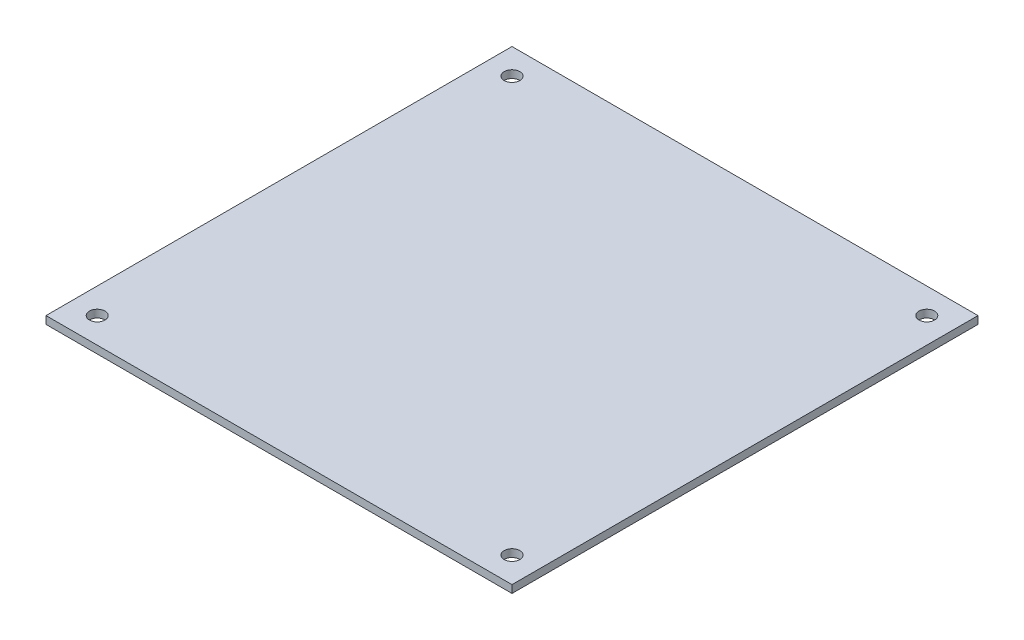
ISO-10303-21;
HEADER;
FILE_DESCRIPTION(('STEP AP214'),'2;1');
FILE_NAME('part.step','',(''),(''),'','','');
FILE_SCHEMA(('AUTOMOTIVE_DESIGN { 1 0 10303 214 1 1 1 1 }'));
ENDSEC;
DATA;
#1=APPLICATION_CONTEXT('core data for automotive mechanical design processes');
#2=APPLICATION_PROTOCOL_DEFINITION('international standard','automotive_design',2000,#1);
#3=PRODUCT_CONTEXT('',#1,'mechanical');
#4=PRODUCT('Part','Part','',(#3));
#5=PRODUCT_RELATED_PRODUCT_CATEGORY('part','',(#4));
#6=PRODUCT_DEFINITION_FORMATION('','',#4);
#7=PRODUCT_DEFINITION_CONTEXT('part definition',#1,'design');
#8=PRODUCT_DEFINITION('design','',#6,#7);
#9=PRODUCT_DEFINITION_SHAPE('','',#8);
#10=(LENGTH_UNIT() NAMED_UNIT(*) SI_UNIT(.MILLI.,.METRE.));
#11=(NAMED_UNIT(*) PLANE_ANGLE_UNIT() SI_UNIT($,.RADIAN.));
#12=(NAMED_UNIT(*) SI_UNIT($,.STERADIAN.) SOLID_ANGLE_UNIT());
#13=UNCERTAINTY_MEASURE_WITH_UNIT(LENGTH_MEASURE(1.E-05),#10,'distance_accuracy_value','');
#14=(GEOMETRIC_REPRESENTATION_CONTEXT(3) GLOBAL_UNCERTAINTY_ASSIGNED_CONTEXT((#13)) GLOBAL_UNIT_ASSIGNED_CONTEXT((#10,
#11,#12)) REPRESENTATION_CONTEXT('',''));
#15=CARTESIAN_POINT('',(0.,0.,0.));
#16=DIRECTION('',(0.,0.,1.));
#17=DIRECTION('',(1.,0.,0.));
#18=AXIS2_PLACEMENT_3D('',#15,#16,#17);
#19=CARTESIAN_POINT('',(0.,1.5,45.5));
#20=DIRECTION('',(0.,0.,-1.));
#21=DIRECTION('',(-1.,0.,0.));
#22=AXIS2_PLACEMENT_3D('',#19,#20,#21);
#23=PLANE('',#22);
#24=DIRECTION('',(1.,0.,0.));
#25=VECTOR('',#24,1.);
#26=CARTESIAN_POINT('',(0.,0.,45.5));
#27=LINE('',#26,#25);
#28=CARTESIAN_POINT('',(-45.5,0.,45.5));
#29=VERTEX_POINT('',#28);
#30=CARTESIAN_POINT('',(45.5,0.,45.5));
#31=VERTEX_POINT('',#30);
#32=EDGE_CURVE('E111',#29,#31,#27,.T.);
#33=ORIENTED_EDGE('',*,*,#32,.T.);
#34=DIRECTION('',(0.,-1.,0.));
#35=VECTOR('',#34,1.);
#36=CARTESIAN_POINT('',(45.5,1.5,45.5));
#37=LINE('',#36,#35);
#38=CARTESIAN_POINT('',(45.5,1.5,45.5));
#39=VERTEX_POINT('',#38);
#40=EDGE_CURVE('E11',#39,#31,#37,.T.);
#41=ORIENTED_EDGE('',*,*,#40,.F.);
#42=DIRECTION('',(1.,0.,0.));
#43=VECTOR('',#42,1.);
#44=CARTESIAN_POINT('',(0.,1.5,45.5));
#45=LINE('',#44,#43);
#46=CARTESIAN_POINT('',(-45.5,1.5,45.5));
#47=VERTEX_POINT('',#46);
#48=EDGE_CURVE('E85',#47,#39,#45,.T.);
#49=ORIENTED_EDGE('',*,*,#48,.F.);
#50=DIRECTION('',(0.,-1.,0.));
#51=VECTOR('',#50,1.);
#52=CARTESIAN_POINT('',(-45.5,1.5,45.5));
#53=LINE('',#52,#51);
#54=EDGE_CURVE('E51',#47,#29,#53,.T.);
#55=ORIENTED_EDGE('',*,*,#54,.T.);
#56=EDGE_LOOP('',(#33,#41,#49,#55));
#57=FACE_BOUND('',#56,.T.);
#58=ADVANCED_FACE('F35',(#57),#23,.F.);
#59=CARTESIAN_POINT('',(45.5,1.5,0.));
#60=DIRECTION('',(-1.,0.,0.));
#61=DIRECTION('',(0.,0.,1.));
#62=AXIS2_PLACEMENT_3D('',#59,#60,#61);
#63=PLANE('',#62);
#64=DIRECTION('',(0.,0.,-1.));
#65=VECTOR('',#64,1.);
#66=CARTESIAN_POINT('',(45.5,0.,0.));
#67=LINE('',#66,#65);
#68=CARTESIAN_POINT('',(45.5,0.,-45.5));
#69=VERTEX_POINT('',#68);
#70=EDGE_CURVE('E90',#31,#69,#67,.T.);
#71=ORIENTED_EDGE('',*,*,#70,.T.);
#72=DIRECTION('',(0.,-1.,0.));
#73=VECTOR('',#72,1.);
#74=CARTESIAN_POINT('',(45.5,1.5,-45.5));
#75=LINE('',#74,#73);
#76=CARTESIAN_POINT('',(45.5,1.5,-45.5));
#77=VERTEX_POINT('',#76);
#78=EDGE_CURVE('E43',#77,#69,#75,.T.);
#79=ORIENTED_EDGE('',*,*,#78,.F.);
#80=DIRECTION('',(0.,0.,-1.));
#81=VECTOR('',#80,1.);
#82=CARTESIAN_POINT('',(45.5,1.5,0.));
#83=LINE('',#82,#81);
#84=EDGE_CURVE('E76',#39,#77,#83,.T.);
#85=ORIENTED_EDGE('',*,*,#84,.F.);
#86=ORIENTED_EDGE('',*,*,#40,.T.);
#87=EDGE_LOOP('',(#71,#79,#85,#86));
#88=FACE_BOUND('',#87,.T.);
#89=ADVANCED_FACE('F89',(#88),#63,.F.);
#90=CARTESIAN_POINT('',(0.,1.5,-45.5));
#91=DIRECTION('',(0.,0.,-1.));
#92=DIRECTION('',(-1.,0.,0.));
#93=AXIS2_PLACEMENT_3D('',#90,#91,#92);
#94=PLANE('',#93);
#95=DIRECTION('',(1.,0.,0.));
#96=VECTOR('',#95,1.);
#97=CARTESIAN_POINT('',(0.,0.,-45.5));
#98=LINE('',#97,#96);
#99=CARTESIAN_POINT('',(-45.5,0.,-45.5));
#100=VERTEX_POINT('',#99);
#101=EDGE_CURVE('E114',#100,#69,#98,.T.);
#102=ORIENTED_EDGE('',*,*,#101,.F.);
#103=DIRECTION('',(0.,-1.,0.));
#104=VECTOR('',#103,1.);
#105=CARTESIAN_POINT('',(-45.5,1.5,-45.5));
#106=LINE('',#105,#104);
#107=CARTESIAN_POINT('',(-45.5,1.5,-45.5));
#108=VERTEX_POINT('',#107);
#109=EDGE_CURVE('E65',#108,#100,#106,.T.);
#110=ORIENTED_EDGE('',*,*,#109,.F.);
#111=DIRECTION('',(1.,0.,0.));
#112=VECTOR('',#111,1.);
#113=CARTESIAN_POINT('',(0.,1.5,-45.5));
#114=LINE('',#113,#112);
#115=EDGE_CURVE('E84',#108,#77,#114,.T.);
#116=ORIENTED_EDGE('',*,*,#115,.T.);
#117=ORIENTED_EDGE('',*,*,#78,.T.);
#118=EDGE_LOOP('',(#102,#110,#116,#117));
#119=FACE_BOUND('',#118,.T.);
#120=ADVANCED_FACE('F93',(#119),#94,.T.);
#121=CARTESIAN_POINT('',(40.5,1.5,40.5));
#122=DIRECTION('',(0.,-1.,0.));
#123=DIRECTION('',(0.,0.,-1.));
#124=AXIS2_PLACEMENT_3D('',#121,#122,#123);
#125=CYLINDRICAL_SURFACE('',#124,1.524);
#126=CARTESIAN_POINT('',(40.5,1.5,40.5));
#127=DIRECTION('',(0.,1.,0.));
#128=DIRECTION('',(0.,0.,1.));
#129=AXIS2_PLACEMENT_3D('',#126,#127,#128);
#130=CIRCLE('',#129,1.524);
#131=CARTESIAN_POINT('',(40.5,1.5,42.024));
#132=VERTEX_POINT('',#131);
#133=EDGE_CURVE('E105',#132,#132,#130,.T.);
#134=ORIENTED_EDGE('',*,*,#133,.T.);
#135=EDGE_LOOP('',(#134));
#136=FACE_BOUND('',#135,.T.);
#137=CARTESIAN_POINT('',(40.5,0.,40.5));
#138=DIRECTION('',(0.,1.,0.));
#139=DIRECTION('',(0.,0.,1.));
#140=AXIS2_PLACEMENT_3D('',#137,#138,#139);
#141=CIRCLE('',#140,1.524);
#142=CARTESIAN_POINT('',(40.5,0.,42.024));
#143=VERTEX_POINT('',#142);
#144=EDGE_CURVE('E125',#143,#143,#141,.T.);
#145=ORIENTED_EDGE('',*,*,#144,.F.);
#146=EDGE_LOOP('',(#145));
#147=FACE_BOUND('',#146,.T.);
#148=ADVANCED_FACE('F163',(#136,#147),#125,.F.);
#149=CARTESIAN_POINT('',(40.5,1.5,-40.5));
#150=DIRECTION('',(0.,-1.,0.));
#151=DIRECTION('',(0.,0.,-1.));
#152=AXIS2_PLACEMENT_3D('',#149,#150,#151);
#153=CYLINDRICAL_SURFACE('',#152,1.524);
#154=CARTESIAN_POINT('',(40.5,1.5,-40.5));
#155=DIRECTION('',(0.,1.,0.));
#156=DIRECTION('',(0.,0.,1.));
#157=AXIS2_PLACEMENT_3D('',#154,#155,#156);
#158=CIRCLE('',#157,1.524);
#159=CARTESIAN_POINT('',(40.5,1.5,-38.976));
#160=VERTEX_POINT('',#159);
#161=EDGE_CURVE('E102',#160,#160,#158,.T.);
#162=ORIENTED_EDGE('',*,*,#161,.T.);
#163=EDGE_LOOP('',(#162));
#164=FACE_BOUND('',#163,.T.);
#165=CARTESIAN_POINT('',(40.5,0.,-40.5));
#166=DIRECTION('',(0.,1.,0.));
#167=DIRECTION('',(0.,0.,1.));
#168=AXIS2_PLACEMENT_3D('',#165,#166,#167);
#169=CIRCLE('',#168,1.524);
#170=CARTESIAN_POINT('',(40.5,0.,-38.976));
#171=VERTEX_POINT('',#170);
#172=EDGE_CURVE('E122',#171,#171,#169,.T.);
#173=ORIENTED_EDGE('',*,*,#172,.F.);
#174=EDGE_LOOP('',(#173));
#175=FACE_BOUND('',#174,.T.);
#176=ADVANCED_FACE('F165',(#164,#175),#153,.F.);
#177=CARTESIAN_POINT('',(-40.5,1.5,-40.5));
#178=DIRECTION('',(0.,-1.,0.));
#179=DIRECTION('',(0.,0.,-1.));
#180=AXIS2_PLACEMENT_3D('',#177,#178,#179);
#181=CYLINDRICAL_SURFACE('',#180,1.524);
#182=CARTESIAN_POINT('',(-40.5,1.5,-40.5));
#183=DIRECTION('',(0.,1.,0.));
#184=DIRECTION('',(0.,0.,1.));
#185=AXIS2_PLACEMENT_3D('',#182,#183,#184);
#186=CIRCLE('',#185,1.524);
#187=CARTESIAN_POINT('',(-40.5,1.5,-38.976));
#188=VERTEX_POINT('',#187);
#189=EDGE_CURVE('E96',#188,#188,#186,.T.);
#190=ORIENTED_EDGE('',*,*,#189,.T.);
#191=EDGE_LOOP('',(#190));
#192=FACE_BOUND('',#191,.T.);
#193=CARTESIAN_POINT('',(-40.5,0.,-40.5));
#194=DIRECTION('',(0.,1.,0.));
#195=DIRECTION('',(0.,0.,1.));
#196=AXIS2_PLACEMENT_3D('',#193,#194,#195);
#197=CIRCLE('',#196,1.524);
#198=CARTESIAN_POINT('',(-40.5,0.,-38.976));
#199=VERTEX_POINT('',#198);
#200=EDGE_CURVE('E119',#199,#199,#197,.T.);
#201=ORIENTED_EDGE('',*,*,#200,.F.);
#202=EDGE_LOOP('',(#201));
#203=FACE_BOUND('',#202,.T.);
#204=ADVANCED_FACE('F146',(#192,#203),#181,.F.);
#205=CARTESIAN_POINT('',(-45.5,1.5,0.));
#206=DIRECTION('',(-1.,0.,0.));
#207=DIRECTION('',(0.,0.,1.));
#208=AXIS2_PLACEMENT_3D('',#205,#206,#207);
#209=PLANE('',#208);
#210=DIRECTION('',(0.,0.,-1.));
#211=VECTOR('',#210,1.);
#212=CARTESIAN_POINT('',(-45.5,0.,0.));
#213=LINE('',#212,#211);
#214=EDGE_CURVE('E116',#29,#100,#213,.T.);
#215=ORIENTED_EDGE('',*,*,#214,.F.);
#216=ORIENTED_EDGE('',*,*,#54,.F.);
#217=DIRECTION('',(0.,0.,-1.));
#218=VECTOR('',#217,1.);
#219=CARTESIAN_POINT('',(-45.5,1.5,0.));
#220=LINE('',#219,#218);
#221=EDGE_CURVE('E94',#47,#108,#220,.T.);
#222=ORIENTED_EDGE('',*,*,#221,.T.);
#223=ORIENTED_EDGE('',*,*,#109,.T.);
#224=EDGE_LOOP('',(#215,#216,#222,#223));
#225=FACE_BOUND('',#224,.T.);
#226=ADVANCED_FACE('F138',(#225),#209,.T.);
#227=CARTESIAN_POINT('',(-40.5,1.5,40.5));
#228=DIRECTION('',(0.,-1.,0.));
#229=DIRECTION('',(0.,0.,-1.));
#230=AXIS2_PLACEMENT_3D('',#227,#228,#229);
#231=CYLINDRICAL_SURFACE('',#230,1.524);
#232=CARTESIAN_POINT('',(-40.5,1.5,40.5));
#233=DIRECTION('',(0.,1.,0.));
#234=DIRECTION('',(0.,0.,1.));
#235=AXIS2_PLACEMENT_3D('',#232,#233,#234);
#236=CIRCLE('',#235,1.524);
#237=CARTESIAN_POINT('',(-40.5,1.5,42.024));
#238=VERTEX_POINT('',#237);
#239=EDGE_CURVE('E108',#238,#238,#236,.T.);
#240=ORIENTED_EDGE('',*,*,#239,.T.);
#241=EDGE_LOOP('',(#240));
#242=FACE_BOUND('',#241,.T.);
#243=CARTESIAN_POINT('',(-40.5,0.,40.5));
#244=DIRECTION('',(0.,1.,0.));
#245=DIRECTION('',(0.,0.,1.));
#246=AXIS2_PLACEMENT_3D('',#243,#244,#245);
#247=CIRCLE('',#246,1.524);
#248=CARTESIAN_POINT('',(-40.5,0.,42.024));
#249=VERTEX_POINT('',#248);
#250=EDGE_CURVE('E128',#249,#249,#247,.T.);
#251=ORIENTED_EDGE('',*,*,#250,.F.);
#252=EDGE_LOOP('',(#251));
#253=FACE_BOUND('',#252,.T.);
#254=ADVANCED_FACE('F136',(#242,#253),#231,.F.);
#255=CARTESIAN_POINT('',(0.,1.5,0.));
#256=DIRECTION('',(0.,1.,0.));
#257=DIRECTION('',(0.,0.,1.));
#258=AXIS2_PLACEMENT_3D('',#255,#256,#257);
#259=PLANE('',#258);
#260=ORIENTED_EDGE('',*,*,#48,.T.);
#261=ORIENTED_EDGE('',*,*,#84,.T.);
#262=ORIENTED_EDGE('',*,*,#115,.F.);
#263=ORIENTED_EDGE('',*,*,#221,.F.);
#264=EDGE_LOOP('',(#260,#261,#262,#263));
#265=FACE_BOUND('',#264,.T.);
#266=ORIENTED_EDGE('',*,*,#189,.F.);
#267=EDGE_LOOP('',(#266));
#268=FACE_BOUND('',#267,.T.);
#269=ORIENTED_EDGE('',*,*,#161,.F.);
#270=EDGE_LOOP('',(#269));
#271=FACE_BOUND('',#270,.T.);
#272=ORIENTED_EDGE('',*,*,#133,.F.);
#273=EDGE_LOOP('',(#272));
#274=FACE_BOUND('',#273,.T.);
#275=ORIENTED_EDGE('',*,*,#239,.F.);
#276=EDGE_LOOP('',(#275));
#277=FACE_BOUND('',#276,.T.);
#278=ADVANCED_FACE('F80',(#265,#268,#271,#274,#277),#259,.T.);
#279=CARTESIAN_POINT('',(0.,0.,0.));
#280=DIRECTION('',(0.,1.,0.));
#281=DIRECTION('',(0.,0.,1.));
#282=AXIS2_PLACEMENT_3D('',#279,#280,#281);
#283=PLANE('',#282);
#284=ORIENTED_EDGE('',*,*,#32,.F.);
#285=ORIENTED_EDGE('',*,*,#214,.T.);
#286=ORIENTED_EDGE('',*,*,#101,.T.);
#287=ORIENTED_EDGE('',*,*,#70,.F.);
#288=EDGE_LOOP('',(#284,#285,#286,#287));
#289=FACE_BOUND('',#288,.T.);
#290=ORIENTED_EDGE('',*,*,#200,.T.);
#291=EDGE_LOOP('',(#290));
#292=FACE_BOUND('',#291,.T.);
#293=ORIENTED_EDGE('',*,*,#172,.T.);
#294=EDGE_LOOP('',(#293));
#295=FACE_BOUND('',#294,.T.);
#296=ORIENTED_EDGE('',*,*,#144,.T.);
#297=EDGE_LOOP('',(#296));
#298=FACE_BOUND('',#297,.T.);
#299=ORIENTED_EDGE('',*,*,#250,.T.);
#300=EDGE_LOOP('',(#299));
#301=FACE_BOUND('',#300,.T.);
#302=ADVANCED_FACE('F134',(#289,#292,#295,#298,#301),#283,.F.);
#303=CLOSED_SHELL('',(#58,#89,#120,#148,#176,#204,#226,#254,#278,#302));
#304=MANIFOLD_SOLID_BREP('B2',#303);
#305=ADVANCED_BREP_SHAPE_REPRESENTATION('',(#18,#304),#14);
#306=SHAPE_DEFINITION_REPRESENTATION(#9,#305);
ENDSEC;
END-ISO-10303-21;
